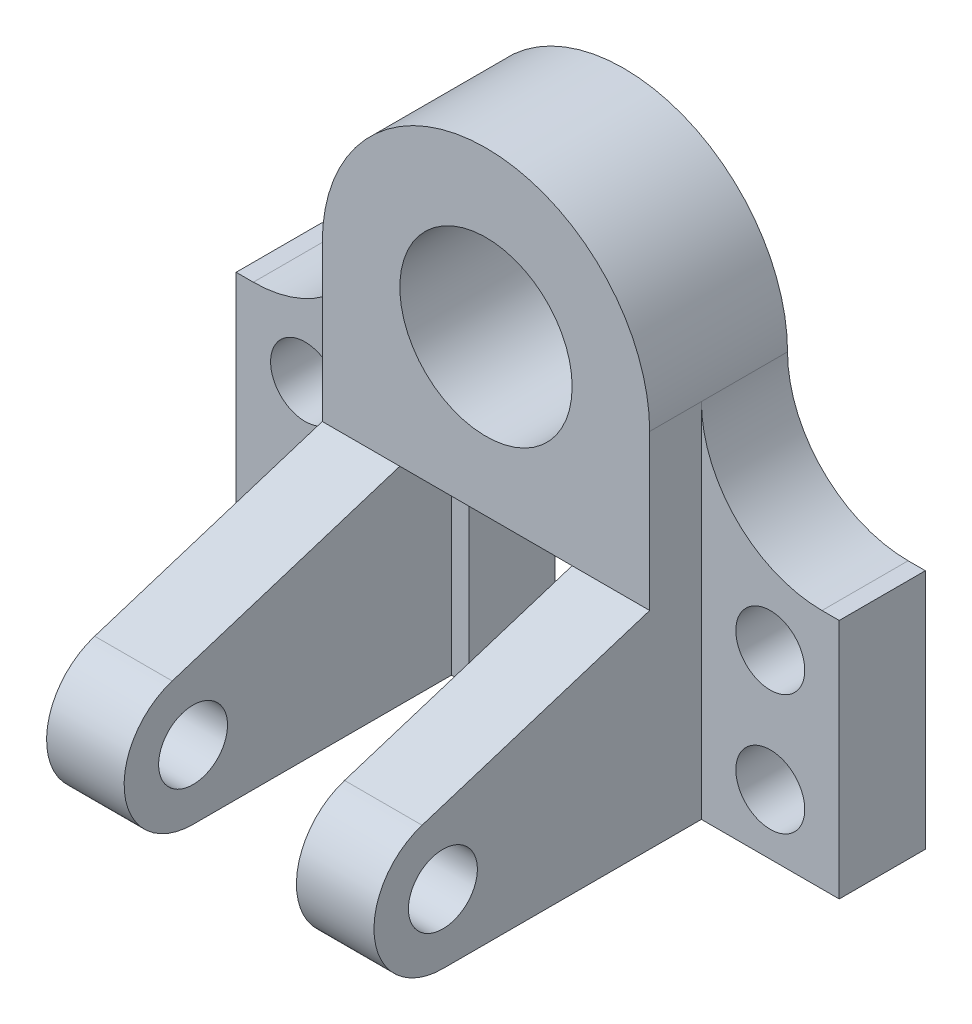
ISO-10303-21;
HEADER;
FILE_DESCRIPTION(('STEP AP214'),'2;1');
FILE_NAME('part.step','',(''),(''),'','','');
FILE_SCHEMA(('AUTOMOTIVE_DESIGN { 1 0 10303 214 1 1 1 1 }'));
ENDSEC;
DATA;
#1=APPLICATION_CONTEXT('core data for automotive mechanical design processes');
#2=APPLICATION_PROTOCOL_DEFINITION('international standard','automotive_design',2000,#1);
#3=PRODUCT_CONTEXT('',#1,'mechanical');
#4=PRODUCT('Part','Part','',(#3));
#5=PRODUCT_RELATED_PRODUCT_CATEGORY('part','',(#4));
#6=PRODUCT_DEFINITION_FORMATION('','',#4);
#7=PRODUCT_DEFINITION_CONTEXT('part definition',#1,'design');
#8=PRODUCT_DEFINITION('design','',#6,#7);
#9=PRODUCT_DEFINITION_SHAPE('','',#8);
#10=(LENGTH_UNIT() NAMED_UNIT(*) SI_UNIT(.MILLI.,.METRE.));
#11=(NAMED_UNIT(*) PLANE_ANGLE_UNIT() SI_UNIT($,.RADIAN.));
#12=(NAMED_UNIT(*) SI_UNIT($,.STERADIAN.) SOLID_ANGLE_UNIT());
#13=UNCERTAINTY_MEASURE_WITH_UNIT(LENGTH_MEASURE(1.E-05),#10,'distance_accuracy_value','');
#14=(GEOMETRIC_REPRESENTATION_CONTEXT(3) GLOBAL_UNCERTAINTY_ASSIGNED_CONTEXT((#13)) GLOBAL_UNIT_ASSIGNED_CONTEXT((#10,
#11,#12)) REPRESENTATION_CONTEXT('',''));
#15=CARTESIAN_POINT('',(0.,0.,0.));
#16=DIRECTION('',(0.,0.,1.));
#17=DIRECTION('',(1.,0.,0.));
#18=AXIS2_PLACEMENT_3D('',#15,#16,#17);
#19=CARTESIAN_POINT('',(-38.,-36.,32.));
#20=DIRECTION('',(0.,1.,0.));
#21=DIRECTION('',(0.,0.,1.));
#22=AXIS2_PLACEMENT_3D('',#19,#20,#21);
#23=PLANE('',#22);
#24=DIRECTION('',(0.,0.,-1.));
#25=VECTOR('',#24,1.);
#26=CARTESIAN_POINT('',(-20.,-36.,0.));
#27=LINE('',#26,#25);
#28=CARTESIAN_POINT('',(-20.,-36.,32.));
#29=VERTEX_POINT('',#28);
#30=CARTESIAN_POINT('',(-20.,-36.,20.));
#31=VERTEX_POINT('',#30);
#32=EDGE_CURVE('E324',#29,#31,#27,.T.);
#33=ORIENTED_EDGE('',*,*,#32,.T.);
#34=DIRECTION('',(-1.,0.,0.));
#35=VECTOR('',#34,1.);
#36=CARTESIAN_POINT('',(-16.,-36.,20.));
#37=LINE('',#36,#35);
#38=CARTESIAN_POINT('',(-16.,-36.,20.));
#39=VERTEX_POINT('',#38);
#40=EDGE_CURVE('E197',#39,#31,#37,.T.);
#41=ORIENTED_EDGE('',*,*,#40,.F.);
#42=DIRECTION('',(0.,0.,-1.));
#43=VECTOR('',#42,1.);
#44=CARTESIAN_POINT('',(-16.,-36.,0.));
#45=LINE('',#44,#43);
#46=CARTESIAN_POINT('',(-16.,-36.,0.));
#47=VERTEX_POINT('',#46);
#48=EDGE_CURVE('E186',#39,#47,#45,.T.);
#49=ORIENTED_EDGE('',*,*,#48,.T.);
#50=DIRECTION('',(1.,0.,0.));
#51=VECTOR('',#50,1.);
#52=CARTESIAN_POINT('',(-38.,-36.,0.));
#53=LINE('',#52,#51);
#54=CARTESIAN_POINT('',(16.,-36.,0.));
#55=VERTEX_POINT('',#54);
#56=EDGE_CURVE('E196',#47,#55,#53,.T.);
#57=ORIENTED_EDGE('',*,*,#56,.T.);
#58=DIRECTION('',(0.,0.,-1.));
#59=VECTOR('',#58,1.);
#60=CARTESIAN_POINT('',(16.,-36.,0.));
#61=LINE('',#60,#59);
#62=CARTESIAN_POINT('',(16.,-36.,20.));
#63=VERTEX_POINT('',#62);
#64=EDGE_CURVE('E56',#63,#55,#61,.T.);
#65=ORIENTED_EDGE('',*,*,#64,.F.);
#66=DIRECTION('',(1.,0.,0.));
#67=VECTOR('',#66,1.);
#68=CARTESIAN_POINT('',(16.,-36.,20.));
#69=LINE('',#68,#67);
#70=CARTESIAN_POINT('',(20.,-36.,20.));
#71=VERTEX_POINT('',#70);
#72=EDGE_CURVE('E492',#63,#71,#69,.T.);
#73=ORIENTED_EDGE('',*,*,#72,.T.);
#74=DIRECTION('',(0.,0.,-1.));
#75=VECTOR('',#74,1.);
#76=CARTESIAN_POINT('',(20.,-36.,20.));
#77=LINE('',#76,#75);
#78=CARTESIAN_POINT('',(20.,-36.,32.));
#79=VERTEX_POINT('',#78);
#80=EDGE_CURVE('E356',#79,#71,#77,.T.);
#81=ORIENTED_EDGE('',*,*,#80,.F.);
#82=DIRECTION('',(1.,0.,0.));
#83=VECTOR('',#82,1.);
#84=CARTESIAN_POINT('',(-38.,-36.,32.));
#85=LINE('',#84,#83);
#86=EDGE_CURVE('E286',#29,#79,#85,.T.);
#87=ORIENTED_EDGE('',*,*,#86,.F.);
#88=EDGE_LOOP('',(#33,#41,#49,#57,#65,#73,#81,#87));
#89=FACE_BOUND('',#88,.T.);
#90=ADVANCED_FACE('F33',(#89),#23,.F.);
#91=CARTESIAN_POINT('',(20.,-68.,80.));
#92=DIRECTION('',(1.,0.,0.));
#93=DIRECTION('',(0.,0.,-1.));
#94=AXIS2_PLACEMENT_3D('',#91,#92,#93);
#95=PLANE('',#94);
#96=CARTESIAN_POINT('',(20.,-68.,80.));
#97=DIRECTION('',(-1.,0.,0.));
#98=DIRECTION('',(0.,0.,1.));
#99=AXIS2_PLACEMENT_3D('',#96,#97,#98);
#100=CIRCLE('',#99,8.00000000000003);
#101=CARTESIAN_POINT('',(20.,-68.,88.));
#102=VERTEX_POINT('',#101);
#103=EDGE_CURVE('E342',#102,#102,#100,.T.);
#104=ORIENTED_EDGE('',*,*,#103,.F.);
#105=EDGE_LOOP('',(#104));
#106=FACE_BOUND('',#105,.T.);
#107=DIRECTION('',(0.,1.,0.));
#108=VECTOR('',#107,1.);
#109=CARTESIAN_POINT('',(20.,-36.,20.));
#110=LINE('',#109,#108);
#111=CARTESIAN_POINT('',(20.,-84.,20.));
#112=VERTEX_POINT('',#111);
#113=EDGE_CURVE('E484',#112,#71,#110,.T.);
#114=ORIENTED_EDGE('',*,*,#113,.F.);
#115=DIRECTION('',(0.,0.,1.));
#116=VECTOR('',#115,1.);
#117=CARTESIAN_POINT('',(20.,-84.,20.));
#118=LINE('',#117,#116);
#119=CARTESIAN_POINT('',(20.,-84.,80.));
#120=VERTEX_POINT('',#119);
#121=EDGE_CURVE('E348',#112,#120,#118,.T.);
#122=ORIENTED_EDGE('',*,*,#121,.T.);
#123=CARTESIAN_POINT('',(20.,-68.,80.));
#124=DIRECTION('',(-1.,0.,0.));
#125=DIRECTION('',(0.,0.,-1.));
#126=AXIS2_PLACEMENT_3D('',#123,#124,#125);
#127=CIRCLE('',#126,16.);
#128=CARTESIAN_POINT('',(20.,-52.7479324979529,84.8347116680314));
#129=VERTEX_POINT('',#128);
#130=EDGE_CURVE('E350',#120,#129,#127,.T.);
#131=ORIENTED_EDGE('',*,*,#130,.T.);
#132=DIRECTION('',(0.,0.302169479251963,-0.953254218877943));
#133=VECTOR('',#132,1.);
#134=CARTESIAN_POINT('',(20.,-36.,32.));
#135=LINE('',#134,#133);
#136=EDGE_CURVE('E353',#129,#79,#135,.T.);
#137=ORIENTED_EDGE('',*,*,#136,.T.);
#138=ORIENTED_EDGE('',*,*,#80,.T.);
#139=EDGE_LOOP('',(#114,#122,#131,#137,#138));
#140=FACE_BOUND('',#139,.T.);
#141=ADVANCED_FACE('F432',(#106,#140),#95,.F.);
#142=CARTESIAN_POINT('',(0.,0.,32.));
#143=DIRECTION('',(0.,0.,1.));
#144=DIRECTION('',(1.,0.,0.));
#145=AXIS2_PLACEMENT_3D('',#142,#143,#144);
#146=PLANE('',#145);
#147=CARTESIAN_POINT('',(0.,0.,32.));
#148=DIRECTION('',(0.,0.,1.));
#149=DIRECTION('',(1.,0.,0.));
#150=AXIS2_PLACEMENT_3D('',#147,#148,#149);
#151=CIRCLE('',#150,38.);
#152=CARTESIAN_POINT('',(38.,0.,32.));
#153=VERTEX_POINT('',#152);
#154=CARTESIAN_POINT('',(-38.,0.,32.));
#155=VERTEX_POINT('',#154);
#156=EDGE_CURVE('E205',#153,#155,#151,.T.);
#157=ORIENTED_EDGE('',*,*,#156,.T.);
#158=DIRECTION('',(0.,-1.,0.));
#159=VECTOR('',#158,1.);
#160=CARTESIAN_POINT('',(-38.,0.,32.));
#161=LINE('',#160,#159);
#162=CARTESIAN_POINT('',(-38.,-36.,32.));
#163=VERTEX_POINT('',#162);
#164=EDGE_CURVE('E209',#155,#163,#161,.T.);
#165=ORIENTED_EDGE('',*,*,#164,.T.);
#166=EDGE_CURVE('E287',#163,#29,#85,.T.);
#167=ORIENTED_EDGE('',*,*,#166,.T.);
#168=ORIENTED_EDGE('',*,*,#86,.T.);
#169=DIRECTION('',(1.,0.,0.));
#170=VECTOR('',#169,1.);
#171=CARTESIAN_POINT('',(20.,-36.,32.));
#172=LINE('',#171,#170);
#173=CARTESIAN_POINT('',(38.,-36.,32.));
#174=VERTEX_POINT('',#173);
#175=EDGE_CURVE('E297',#79,#174,#172,.T.);
#176=ORIENTED_EDGE('',*,*,#175,.T.);
#177=DIRECTION('',(0.,1.,0.));
#178=VECTOR('',#177,1.);
#179=CARTESIAN_POINT('',(38.,0.,32.));
#180=LINE('',#179,#178);
#181=EDGE_CURVE('E289',#174,#153,#180,.T.);
#182=ORIENTED_EDGE('',*,*,#181,.T.);
#183=EDGE_LOOP('',(#157,#165,#167,#168,#176,#182));
#184=FACE_BOUND('',#183,.T.);
#185=CARTESIAN_POINT('',(0.,0.,32.));
#186=DIRECTION('',(0.,0.,1.));
#187=DIRECTION('',(1.,0.,0.));
#188=AXIS2_PLACEMENT_3D('',#185,#186,#187);
#189=CIRCLE('',#188,20.);
#190=CARTESIAN_POINT('',(20.,0.,32.));
#191=VERTEX_POINT('',#190);
#192=EDGE_CURVE('E212',#191,#191,#189,.T.);
#193=ORIENTED_EDGE('',*,*,#192,.F.);
#194=EDGE_LOOP('',(#193));
#195=FACE_BOUND('',#194,.T.);
#196=ADVANCED_FACE('F293',(#184,#195),#146,.T.);
#197=CARTESIAN_POINT('',(0.,0.,0.));
#198=DIRECTION('',(0.,0.,1.));
#199=DIRECTION('',(1.,0.,0.));
#200=AXIS2_PLACEMENT_3D('',#197,#198,#199);
#201=PLANE('',#200);
#202=ORIENTED_EDGE('',*,*,#56,.F.);
#203=DIRECTION('',(0.,-1.,0.));
#204=VECTOR('',#203,1.);
#205=CARTESIAN_POINT('',(-16.,-36.,0.));
#206=LINE('',#205,#204);
#207=CARTESIAN_POINT('',(-16.,-84.,0.));
#208=VERTEX_POINT('',#207);
#209=EDGE_CURVE('E182',#47,#208,#206,.T.);
#210=ORIENTED_EDGE('',*,*,#209,.T.);
#211=DIRECTION('',(1.,0.,0.));
#212=VECTOR('',#211,1.);
#213=CARTESIAN_POINT('',(-70.,-84.,0.));
#214=LINE('',#213,#212);
#215=CARTESIAN_POINT('',(-70.,-84.,0.));
#216=VERTEX_POINT('',#215);
#217=EDGE_CURVE('E266',#216,#208,#214,.T.);
#218=ORIENTED_EDGE('',*,*,#217,.F.);
#219=DIRECTION('',(0.,-1.,0.));
#220=VECTOR('',#219,1.);
#221=CARTESIAN_POINT('',(-70.,-84.,0.));
#222=LINE('',#221,#220);
#223=CARTESIAN_POINT('',(-70.,-28.,0.));
#224=VERTEX_POINT('',#223);
#225=EDGE_CURVE('E273',#224,#216,#222,.T.);
#226=ORIENTED_EDGE('',*,*,#225,.F.);
#227=DIRECTION('',(-1.,0.,0.));
#228=VECTOR('',#227,1.);
#229=CARTESIAN_POINT('',(-70.,-28.,0.));
#230=LINE('',#229,#228);
#231=CARTESIAN_POINT('',(-66.,-28.,0.));
#232=VERTEX_POINT('',#231);
#233=EDGE_CURVE('E238',#232,#224,#230,.T.);
#234=ORIENTED_EDGE('',*,*,#233,.F.);
#235=CARTESIAN_POINT('',(-66.,0.,0.));
#236=DIRECTION('',(0.,0.,1.));
#237=DIRECTION('',(1.,0.,0.));
#238=AXIS2_PLACEMENT_3D('',#235,#236,#237);
#239=CIRCLE('',#238,28.);
#240=CARTESIAN_POINT('',(-38.,0.,0.));
#241=VERTEX_POINT('',#240);
#242=EDGE_CURVE('E41',#232,#241,#239,.T.);
#243=ORIENTED_EDGE('',*,*,#242,.T.);
#244=CARTESIAN_POINT('',(0.,0.,0.));
#245=DIRECTION('',(0.,0.,1.));
#246=DIRECTION('',(1.,0.,0.));
#247=AXIS2_PLACEMENT_3D('',#244,#245,#246);
#248=CIRCLE('',#247,38.);
#249=CARTESIAN_POINT('',(38.,0.,0.));
#250=VERTEX_POINT('',#249);
#251=EDGE_CURVE('E206',#250,#241,#248,.T.);
#252=ORIENTED_EDGE('',*,*,#251,.F.);
#253=CARTESIAN_POINT('',(66.,0.,0.));
#254=DIRECTION('',(0.,0.,1.));
#255=DIRECTION('',(1.,0.,0.));
#256=AXIS2_PLACEMENT_3D('',#253,#254,#255);
#257=CIRCLE('',#256,28.);
#258=CARTESIAN_POINT('',(66.,-28.,0.));
#259=VERTEX_POINT('',#258);
#260=EDGE_CURVE('E228',#250,#259,#257,.T.);
#261=ORIENTED_EDGE('',*,*,#260,.T.);
#262=DIRECTION('',(1.,0.,0.));
#263=VECTOR('',#262,1.);
#264=CARTESIAN_POINT('',(70.,-28.,0.));
#265=LINE('',#264,#263);
#266=CARTESIAN_POINT('',(70.,-28.,0.));
#267=VERTEX_POINT('',#266);
#268=EDGE_CURVE('E386',#259,#267,#265,.T.);
#269=ORIENTED_EDGE('',*,*,#268,.T.);
#270=DIRECTION('',(0.,-1.,0.));
#271=VECTOR('',#270,1.);
#272=CARTESIAN_POINT('',(70.,-84.,0.));
#273=LINE('',#272,#271);
#274=CARTESIAN_POINT('',(70.,-84.,0.));
#275=VERTEX_POINT('',#274);
#276=EDGE_CURVE('E393',#267,#275,#273,.T.);
#277=ORIENTED_EDGE('',*,*,#276,.T.);
#278=DIRECTION('',(-1.,0.,0.));
#279=VECTOR('',#278,1.);
#280=CARTESIAN_POINT('',(70.,-84.,0.));
#281=LINE('',#280,#279);
#282=CARTESIAN_POINT('',(16.,-84.,0.));
#283=VERTEX_POINT('',#282);
#284=EDGE_CURVE('E379',#275,#283,#281,.T.);
#285=ORIENTED_EDGE('',*,*,#284,.T.);
#286=DIRECTION('',(0.,-1.,0.));
#287=VECTOR('',#286,1.);
#288=CARTESIAN_POINT('',(16.,-36.,0.));
#289=LINE('',#288,#287);
#290=EDGE_CURVE('E204',#55,#283,#289,.T.);
#291=ORIENTED_EDGE('',*,*,#290,.F.);
#292=EDGE_LOOP('',(#202,#210,#218,#226,#234,#243,#252,#261,#269,#277,#285,#291));
#293=FACE_BOUND('',#292,.T.);
#294=CARTESIAN_POINT('',(0.,0.,0.));
#295=DIRECTION('',(0.,0.,1.));
#296=DIRECTION('',(1.,0.,0.));
#297=AXIS2_PLACEMENT_3D('',#294,#295,#296);
#298=CIRCLE('',#297,20.);
#299=CARTESIAN_POINT('',(20.,0.,0.));
#300=VERTEX_POINT('',#299);
#301=EDGE_CURVE('E280',#300,#300,#298,.T.);
#302=ORIENTED_EDGE('',*,*,#301,.T.);
#303=EDGE_LOOP('',(#302));
#304=FACE_BOUND('',#303,.T.);
#305=CARTESIAN_POINT('',(-54.,-42.,0.));
#306=DIRECTION('',(0.,0.,1.));
#307=DIRECTION('',(1.,0.,0.));
#308=AXIS2_PLACEMENT_3D('',#305,#306,#307);
#309=CIRCLE('',#308,8.);
#310=CARTESIAN_POINT('',(-46.,-42.,0.));
#311=VERTEX_POINT('',#310);
#312=EDGE_CURVE('E405',#311,#311,#309,.T.);
#313=ORIENTED_EDGE('',*,*,#312,.T.);
#314=EDGE_LOOP('',(#313));
#315=FACE_BOUND('',#314,.T.);
#316=CARTESIAN_POINT('',(-54.,-70.,0.));
#317=DIRECTION('',(0.,0.,1.));
#318=DIRECTION('',(1.,0.,0.));
#319=AXIS2_PLACEMENT_3D('',#316,#317,#318);
#320=CIRCLE('',#319,8.);
#321=CARTESIAN_POINT('',(-46.,-70.,0.));
#322=VERTEX_POINT('',#321);
#323=EDGE_CURVE('E401',#322,#322,#320,.T.);
#324=ORIENTED_EDGE('',*,*,#323,.T.);
#325=EDGE_LOOP('',(#324));
#326=FACE_BOUND('',#325,.T.);
#327=CARTESIAN_POINT('',(54.,-70.,0.));
#328=DIRECTION('',(0.,0.,-1.));
#329=DIRECTION('',(-1.,0.,0.));
#330=AXIS2_PLACEMENT_3D('',#327,#328,#329);
#331=CIRCLE('',#330,8.);
#332=CARTESIAN_POINT('',(46.,-70.,0.));
#333=VERTEX_POINT('',#332);
#334=EDGE_CURVE('E369',#333,#333,#331,.T.);
#335=ORIENTED_EDGE('',*,*,#334,.F.);
#336=EDGE_LOOP('',(#335));
#337=FACE_BOUND('',#336,.T.);
#338=CARTESIAN_POINT('',(54.,-42.,0.));
#339=DIRECTION('',(0.,0.,-1.));
#340=DIRECTION('',(-1.,0.,0.));
#341=AXIS2_PLACEMENT_3D('',#338,#339,#340);
#342=CIRCLE('',#341,8.);
#343=CARTESIAN_POINT('',(46.,-42.,0.));
#344=VERTEX_POINT('',#343);
#345=EDGE_CURVE('E373',#344,#344,#342,.T.);
#346=ORIENTED_EDGE('',*,*,#345,.F.);
#347=EDGE_LOOP('',(#346));
#348=FACE_BOUND('',#347,.T.);
#349=ADVANCED_FACE('F201',(#293,#304,#315,#326,#337,#348),#201,.F.);
#350=CARTESIAN_POINT('',(0.,0.,32.));
#351=DIRECTION('',(0.,0.,-1.));
#352=DIRECTION('',(-1.,0.,0.));
#353=AXIS2_PLACEMENT_3D('',#350,#351,#352);
#354=CYLINDRICAL_SURFACE('',#353,38.);
#355=ORIENTED_EDGE('',*,*,#251,.T.);
#356=DIRECTION('',(0.,0.,-1.));
#357=VECTOR('',#356,1.);
#358=CARTESIAN_POINT('',(-38.,0.,32.));
#359=LINE('',#358,#357);
#360=CARTESIAN_POINT('',(-38.,0.,20.));
#361=VERTEX_POINT('',#360);
#362=EDGE_CURVE('E219',#361,#241,#359,.T.);
#363=ORIENTED_EDGE('',*,*,#362,.F.);
#364=EDGE_CURVE('E221',#155,#361,#359,.T.);
#365=ORIENTED_EDGE('',*,*,#364,.F.);
#366=ORIENTED_EDGE('',*,*,#156,.F.);
#367=DIRECTION('',(0.,0.,-1.));
#368=VECTOR('',#367,1.);
#369=CARTESIAN_POINT('',(38.,0.,32.));
#370=LINE('',#369,#368);
#371=CARTESIAN_POINT('',(38.,0.,20.));
#372=VERTEX_POINT('',#371);
#373=EDGE_CURVE('E216',#153,#372,#370,.T.);
#374=ORIENTED_EDGE('',*,*,#373,.T.);
#375=EDGE_CURVE('E220',#372,#250,#370,.T.);
#376=ORIENTED_EDGE('',*,*,#375,.T.);
#377=EDGE_LOOP('',(#355,#363,#365,#366,#374,#376));
#378=FACE_BOUND('',#377,.T.);
#379=ADVANCED_FACE('F245',(#378),#354,.T.);
#380=CARTESIAN_POINT('',(-38.,0.,32.));
#381=DIRECTION('',(1.,0.,0.));
#382=DIRECTION('',(0.,1.,0.));
#383=AXIS2_PLACEMENT_3D('',#380,#381,#382);
#384=PLANE('',#383);
#385=ORIENTED_EDGE('',*,*,#364,.T.);
#386=DIRECTION('',(0.,1.,0.));
#387=VECTOR('',#386,1.);
#388=CARTESIAN_POINT('',(-38.,-36.,20.));
#389=LINE('',#388,#387);
#390=CARTESIAN_POINT('',(-38.,-84.,20.));
#391=VERTEX_POINT('',#390);
#392=EDGE_CURVE('E256',#391,#361,#389,.T.);
#393=ORIENTED_EDGE('',*,*,#392,.F.);
#394=DIRECTION('',(0.,0.,1.));
#395=VECTOR('',#394,1.);
#396=CARTESIAN_POINT('',(-38.,-84.,20.));
#397=LINE('',#396,#395);
#398=CARTESIAN_POINT('',(-38.,-84.,80.));
#399=VERTEX_POINT('',#398);
#400=EDGE_CURVE('E336',#391,#399,#397,.T.);
#401=ORIENTED_EDGE('',*,*,#400,.T.);
#402=CARTESIAN_POINT('',(-38.,-68.,80.));
#403=DIRECTION('',(-1.,0.,0.));
#404=DIRECTION('',(0.,0.,-1.));
#405=AXIS2_PLACEMENT_3D('',#402,#403,#404);
#406=CIRCLE('',#405,16.);
#407=CARTESIAN_POINT('',(-38.,-52.7479324979529,84.8347116680314));
#408=VERTEX_POINT('',#407);
#409=EDGE_CURVE('E333',#399,#408,#406,.T.);
#410=ORIENTED_EDGE('',*,*,#409,.T.);
#411=DIRECTION('',(0.,0.302169479251963,-0.953254218877943));
#412=VECTOR('',#411,1.);
#413=CARTESIAN_POINT('',(-38.,-36.,32.));
#414=LINE('',#413,#412);
#415=EDGE_CURVE('E311',#408,#163,#414,.T.);
#416=ORIENTED_EDGE('',*,*,#415,.T.);
#417=ORIENTED_EDGE('',*,*,#164,.F.);
#418=EDGE_LOOP('',(#385,#393,#401,#410,#416,#417));
#419=FACE_BOUND('',#418,.T.);
#420=CARTESIAN_POINT('',(-38.,-68.,80.));
#421=DIRECTION('',(-1.,0.,0.));
#422=DIRECTION('',(0.,0.,1.));
#423=AXIS2_PLACEMENT_3D('',#420,#421,#422);
#424=CIRCLE('',#423,8.00000000000003);
#425=CARTESIAN_POINT('',(-38.,-68.,88.));
#426=VERTEX_POINT('',#425);
#427=EDGE_CURVE('E496',#426,#426,#424,.T.);
#428=ORIENTED_EDGE('',*,*,#427,.F.);
#429=EDGE_LOOP('',(#428));
#430=FACE_BOUND('',#429,.T.);
#431=ADVANCED_FACE('F305',(#419,#430),#384,.F.);
#432=CARTESIAN_POINT('',(38.,0.,32.));
#433=DIRECTION('',(-1.,0.,0.));
#434=DIRECTION('',(0.,-1.,0.));
#435=AXIS2_PLACEMENT_3D('',#432,#433,#434);
#436=PLANE('',#435);
#437=DIRECTION('',(0.,1.,0.));
#438=VECTOR('',#437,1.);
#439=CARTESIAN_POINT('',(38.,0.,20.));
#440=LINE('',#439,#438);
#441=CARTESIAN_POINT('',(38.,-84.,20.));
#442=VERTEX_POINT('',#441);
#443=EDGE_CURVE('E224',#442,#372,#440,.T.);
#444=ORIENTED_EDGE('',*,*,#443,.T.);
#445=ORIENTED_EDGE('',*,*,#373,.F.);
#446=ORIENTED_EDGE('',*,*,#181,.F.);
#447=DIRECTION('',(0.,0.302169479251963,-0.953254218877943));
#448=VECTOR('',#447,1.);
#449=CARTESIAN_POINT('',(38.,-36.,32.));
#450=LINE('',#449,#448);
#451=CARTESIAN_POINT('',(38.,-52.7479324979529,84.8347116680314));
#452=VERTEX_POINT('',#451);
#453=EDGE_CURVE('E351',#452,#174,#450,.T.);
#454=ORIENTED_EDGE('',*,*,#453,.F.);
#455=CARTESIAN_POINT('',(38.,-68.,80.));
#456=DIRECTION('',(-1.,0.,0.));
#457=DIRECTION('',(0.,0.,-1.));
#458=AXIS2_PLACEMENT_3D('',#455,#456,#457);
#459=CIRCLE('',#458,16.);
#460=CARTESIAN_POINT('',(38.,-84.,80.));
#461=VERTEX_POINT('',#460);
#462=EDGE_CURVE('E359',#461,#452,#459,.T.);
#463=ORIENTED_EDGE('',*,*,#462,.F.);
#464=DIRECTION('',(0.,0.,1.));
#465=VECTOR('',#464,1.);
#466=CARTESIAN_POINT('',(38.,-84.,20.));
#467=LINE('',#466,#465);
#468=EDGE_CURVE('E345',#442,#461,#467,.T.);
#469=ORIENTED_EDGE('',*,*,#468,.F.);
#470=EDGE_LOOP('',(#444,#445,#446,#454,#463,#469));
#471=FACE_BOUND('',#470,.T.);
#472=CARTESIAN_POINT('',(38.,-68.,80.));
#473=DIRECTION('',(-1.,0.,0.));
#474=DIRECTION('',(0.,0.,1.));
#475=AXIS2_PLACEMENT_3D('',#472,#473,#474);
#476=CIRCLE('',#475,8.00000000000003);
#477=CARTESIAN_POINT('',(38.,-68.,88.));
#478=VERTEX_POINT('',#477);
#479=EDGE_CURVE('E341',#478,#478,#476,.T.);
#480=ORIENTED_EDGE('',*,*,#479,.T.);
#481=EDGE_LOOP('',(#480));
#482=FACE_BOUND('',#481,.T.);
#483=ADVANCED_FACE('F301',(#471,#482),#436,.F.);
#484=CARTESIAN_POINT('',(0.,0.,32.));
#485=DIRECTION('',(0.,0.,-1.));
#486=DIRECTION('',(-1.,0.,0.));
#487=AXIS2_PLACEMENT_3D('',#484,#485,#486);
#488=CYLINDRICAL_SURFACE('',#487,20.);
#489=ORIENTED_EDGE('',*,*,#192,.T.);
#490=EDGE_LOOP('',(#489));
#491=FACE_BOUND('',#490,.T.);
#492=ORIENTED_EDGE('',*,*,#301,.F.);
#493=EDGE_LOOP('',(#492));
#494=FACE_BOUND('',#493,.T.);
#495=ADVANCED_FACE('F612',(#491,#494),#488,.F.);
#496=CARTESIAN_POINT('',(0.,0.,20.));
#497=DIRECTION('',(0.,0.,1.));
#498=DIRECTION('',(1.,0.,0.));
#499=AXIS2_PLACEMENT_3D('',#496,#497,#498);
#500=PLANE('',#499);
#501=CARTESIAN_POINT('',(-54.,-42.,20.));
#502=DIRECTION('',(0.,0.,1.));
#503=DIRECTION('',(1.,0.,0.));
#504=AXIS2_PLACEMENT_3D('',#501,#502,#503);
#505=CIRCLE('',#504,8.);
#506=CARTESIAN_POINT('',(-46.,-42.,20.));
#507=VERTEX_POINT('',#506);
#508=EDGE_CURVE('E274',#507,#507,#505,.T.);
#509=ORIENTED_EDGE('',*,*,#508,.F.);
#510=EDGE_LOOP('',(#509));
#511=FACE_BOUND('',#510,.T.);
#512=ORIENTED_EDGE('',*,*,#392,.T.);
#513=CARTESIAN_POINT('',(-66.,0.,20.));
#514=DIRECTION('',(0.,0.,1.));
#515=DIRECTION('',(1.,0.,0.));
#516=AXIS2_PLACEMENT_3D('',#513,#514,#515);
#517=CIRCLE('',#516,28.);
#518=CARTESIAN_POINT('',(-66.,-28.,20.));
#519=VERTEX_POINT('',#518);
#520=EDGE_CURVE('E11',#361,#519,#517,.F.);
#521=ORIENTED_EDGE('',*,*,#520,.T.);
#522=DIRECTION('',(-1.,0.,0.));
#523=VECTOR('',#522,1.);
#524=CARTESIAN_POINT('',(-70.,-28.,20.));
#525=LINE('',#524,#523);
#526=CARTESIAN_POINT('',(-70.,-28.,20.));
#527=VERTEX_POINT('',#526);
#528=EDGE_CURVE('E253',#519,#527,#525,.T.);
#529=ORIENTED_EDGE('',*,*,#528,.T.);
#530=DIRECTION('',(0.,-1.,0.));
#531=VECTOR('',#530,1.);
#532=CARTESIAN_POINT('',(-70.,-84.,20.));
#533=LINE('',#532,#531);
#534=CARTESIAN_POINT('',(-70.,-84.,20.));
#535=VERTEX_POINT('',#534);
#536=EDGE_CURVE('E262',#527,#535,#533,.T.);
#537=ORIENTED_EDGE('',*,*,#536,.T.);
#538=DIRECTION('',(1.,0.,0.));
#539=VECTOR('',#538,1.);
#540=CARTESIAN_POINT('',(-70.,-84.,20.));
#541=LINE('',#540,#539);
#542=EDGE_CURVE('E264',#535,#391,#541,.T.);
#543=ORIENTED_EDGE('',*,*,#542,.T.);
#544=EDGE_LOOP('',(#512,#521,#529,#537,#543));
#545=FACE_BOUND('',#544,.T.);
#546=CARTESIAN_POINT('',(-54.,-70.,20.));
#547=DIRECTION('',(0.,0.,1.));
#548=DIRECTION('',(1.,0.,0.));
#549=AXIS2_PLACEMENT_3D('',#546,#547,#548);
#550=CIRCLE('',#549,8.);
#551=CARTESIAN_POINT('',(-46.,-70.,20.));
#552=VERTEX_POINT('',#551);
#553=EDGE_CURVE('E402',#552,#552,#550,.T.);
#554=ORIENTED_EDGE('',*,*,#553,.F.);
#555=EDGE_LOOP('',(#554));
#556=FACE_BOUND('',#555,.T.);
#557=ADVANCED_FACE('F251',(#511,#545,#556),#500,.T.);
#558=CARTESIAN_POINT('',(-70.,-28.,20.));
#559=DIRECTION('',(0.,-1.,0.));
#560=DIRECTION('',(0.,0.,-1.));
#561=AXIS2_PLACEMENT_3D('',#558,#559,#560);
#562=PLANE('',#561);
#563=ORIENTED_EDGE('',*,*,#528,.F.);
#564=DIRECTION('',(0.,0.,-1.));
#565=VECTOR('',#564,1.);
#566=CARTESIAN_POINT('',(-66.,-28.,0.));
#567=LINE('',#566,#565);
#568=EDGE_CURVE('E233',#519,#232,#567,.T.);
#569=ORIENTED_EDGE('',*,*,#568,.T.);
#570=ORIENTED_EDGE('',*,*,#233,.T.);
#571=DIRECTION('',(0.,0.,-1.));
#572=VECTOR('',#571,1.);
#573=CARTESIAN_POINT('',(-70.,-28.,20.));
#574=LINE('',#573,#572);
#575=EDGE_CURVE('E260',#527,#224,#574,.T.);
#576=ORIENTED_EDGE('',*,*,#575,.F.);
#577=EDGE_LOOP('',(#563,#569,#570,#576));
#578=FACE_BOUND('',#577,.T.);
#579=ADVANCED_FACE('F258',(#578),#562,.F.);
#580=CARTESIAN_POINT('',(-70.,-84.,20.));
#581=DIRECTION('',(1.,0.,0.));
#582=DIRECTION('',(0.,1.,0.));
#583=AXIS2_PLACEMENT_3D('',#580,#581,#582);
#584=PLANE('',#583);
#585=ORIENTED_EDGE('',*,*,#225,.T.);
#586=DIRECTION('',(0.,0.,-1.));
#587=VECTOR('',#586,1.);
#588=CARTESIAN_POINT('',(-70.,-84.,20.));
#589=LINE('',#588,#587);
#590=EDGE_CURVE('E271',#535,#216,#589,.T.);
#591=ORIENTED_EDGE('',*,*,#590,.F.);
#592=ORIENTED_EDGE('',*,*,#536,.F.);
#593=ORIENTED_EDGE('',*,*,#575,.T.);
#594=EDGE_LOOP('',(#585,#591,#592,#593));
#595=FACE_BOUND('',#594,.T.);
#596=ADVANCED_FACE('F427',(#595),#584,.F.);
#597=CARTESIAN_POINT('',(-70.,-84.,20.));
#598=DIRECTION('',(0.,1.,0.));
#599=DIRECTION('',(0.,0.,1.));
#600=AXIS2_PLACEMENT_3D('',#597,#598,#599);
#601=PLANE('',#600);
#602=ORIENTED_EDGE('',*,*,#217,.T.);
#603=DIRECTION('',(0.,0.,1.));
#604=VECTOR('',#603,1.);
#605=CARTESIAN_POINT('',(-16.,-84.,0.));
#606=LINE('',#605,#604);
#607=CARTESIAN_POINT('',(-16.,-84.,20.));
#608=VERTEX_POINT('',#607);
#609=EDGE_CURVE('E189',#208,#608,#606,.T.);
#610=ORIENTED_EDGE('',*,*,#609,.T.);
#611=DIRECTION('',(-1.,0.,0.));
#612=VECTOR('',#611,1.);
#613=CARTESIAN_POINT('',(-16.,-84.,20.));
#614=LINE('',#613,#612);
#615=CARTESIAN_POINT('',(-20.,-84.,20.));
#616=VERTEX_POINT('',#615);
#617=EDGE_CURVE('E503',#608,#616,#614,.T.);
#618=ORIENTED_EDGE('',*,*,#617,.T.);
#619=DIRECTION('',(0.,0.,1.));
#620=VECTOR('',#619,1.);
#621=CARTESIAN_POINT('',(-20.,-84.,20.));
#622=LINE('',#621,#620);
#623=CARTESIAN_POINT('',(-20.,-84.,80.));
#624=VERTEX_POINT('',#623);
#625=EDGE_CURVE('E328',#616,#624,#622,.T.);
#626=ORIENTED_EDGE('',*,*,#625,.T.);
#627=DIRECTION('',(-1.,0.,0.));
#628=VECTOR('',#627,1.);
#629=CARTESIAN_POINT('',(-20.,-84.,80.));
#630=LINE('',#629,#628);
#631=EDGE_CURVE('E326',#624,#399,#630,.T.);
#632=ORIENTED_EDGE('',*,*,#631,.T.);
#633=ORIENTED_EDGE('',*,*,#400,.F.);
#634=ORIENTED_EDGE('',*,*,#542,.F.);
#635=ORIENTED_EDGE('',*,*,#590,.T.);
#636=EDGE_LOOP('',(#602,#610,#618,#626,#632,#633,#634,#635));
#637=FACE_BOUND('',#636,.T.);
#638=ADVANCED_FACE('F417',(#637),#601,.F.);
#639=CARTESIAN_POINT('',(-54.,-42.,20.));
#640=DIRECTION('',(0.,0.,-1.));
#641=DIRECTION('',(-1.,0.,0.));
#642=AXIS2_PLACEMENT_3D('',#639,#640,#641);
#643=CYLINDRICAL_SURFACE('',#642,8.);
#644=ORIENTED_EDGE('',*,*,#508,.T.);
#645=EDGE_LOOP('',(#644));
#646=FACE_BOUND('',#645,.T.);
#647=ORIENTED_EDGE('',*,*,#312,.F.);
#648=EDGE_LOOP('',(#647));
#649=FACE_BOUND('',#648,.T.);
#650=ADVANCED_FACE('F414',(#646,#649),#643,.F.);
#651=CARTESIAN_POINT('',(-54.,-70.,20.));
#652=DIRECTION('',(0.,0.,-1.));
#653=DIRECTION('',(-1.,0.,0.));
#654=AXIS2_PLACEMENT_3D('',#651,#652,#653);
#655=CYLINDRICAL_SURFACE('',#654,8.);
#656=ORIENTED_EDGE('',*,*,#553,.T.);
#657=EDGE_LOOP('',(#656));
#658=FACE_BOUND('',#657,.T.);
#659=ORIENTED_EDGE('',*,*,#323,.F.);
#660=EDGE_LOOP('',(#659));
#661=FACE_BOUND('',#660,.T.);
#662=ADVANCED_FACE('F416',(#658,#661),#655,.F.);
#663=CARTESIAN_POINT('',(70.,-84.,20.));
#664=DIRECTION('',(0.,-1.,0.));
#665=DIRECTION('',(0.,0.,-1.));
#666=AXIS2_PLACEMENT_3D('',#663,#664,#665);
#667=PLANE('',#666);
#668=ORIENTED_EDGE('',*,*,#284,.F.);
#669=DIRECTION('',(0.,0.,-1.));
#670=VECTOR('',#669,1.);
#671=CARTESIAN_POINT('',(70.,-84.,20.));
#672=LINE('',#671,#670);
#673=CARTESIAN_POINT('',(70.,-84.,20.));
#674=VERTEX_POINT('',#673);
#675=EDGE_CURVE('E399',#674,#275,#672,.T.);
#676=ORIENTED_EDGE('',*,*,#675,.F.);
#677=DIRECTION('',(-1.,0.,0.));
#678=VECTOR('',#677,1.);
#679=CARTESIAN_POINT('',(70.,-84.,20.));
#680=LINE('',#679,#678);
#681=EDGE_CURVE('E382',#674,#442,#680,.T.);
#682=ORIENTED_EDGE('',*,*,#681,.T.);
#683=ORIENTED_EDGE('',*,*,#468,.T.);
#684=DIRECTION('',(1.,0.,0.));
#685=VECTOR('',#684,1.);
#686=CARTESIAN_POINT('',(20.,-84.,80.));
#687=LINE('',#686,#685);
#688=EDGE_CURVE('E366',#120,#461,#687,.T.);
#689=ORIENTED_EDGE('',*,*,#688,.F.);
#690=ORIENTED_EDGE('',*,*,#121,.F.);
#691=DIRECTION('',(1.,0.,0.));
#692=VECTOR('',#691,1.);
#693=CARTESIAN_POINT('',(16.,-84.,20.));
#694=LINE('',#693,#692);
#695=CARTESIAN_POINT('',(16.,-84.,20.));
#696=VERTEX_POINT('',#695);
#697=EDGE_CURVE('E478',#696,#112,#694,.T.);
#698=ORIENTED_EDGE('',*,*,#697,.F.);
#699=DIRECTION('',(0.,0.,1.));
#700=VECTOR('',#699,1.);
#701=CARTESIAN_POINT('',(16.,-84.,0.));
#702=LINE('',#701,#700);
#703=EDGE_CURVE('E475',#283,#696,#702,.T.);
#704=ORIENTED_EDGE('',*,*,#703,.F.);
#705=EDGE_LOOP('',(#668,#676,#682,#683,#689,#690,#698,#704));
#706=FACE_BOUND('',#705,.T.);
#707=ADVANCED_FACE('F424',(#706),#667,.T.);
#708=CARTESIAN_POINT('',(70.,-84.,20.));
#709=DIRECTION('',(1.,0.,0.));
#710=DIRECTION('',(0.,1.,0.));
#711=AXIS2_PLACEMENT_3D('',#708,#709,#710);
#712=PLANE('',#711);
#713=ORIENTED_EDGE('',*,*,#276,.F.);
#714=DIRECTION('',(0.,0.,-1.));
#715=VECTOR('',#714,1.);
#716=CARTESIAN_POINT('',(70.,-28.,20.));
#717=LINE('',#716,#715);
#718=CARTESIAN_POINT('',(70.,-28.,20.));
#719=VERTEX_POINT('',#718);
#720=EDGE_CURVE('E391',#719,#267,#717,.T.);
#721=ORIENTED_EDGE('',*,*,#720,.F.);
#722=DIRECTION('',(0.,-1.,0.));
#723=VECTOR('',#722,1.);
#724=CARTESIAN_POINT('',(70.,-84.,20.));
#725=LINE('',#724,#723);
#726=EDGE_CURVE('E385',#719,#674,#725,.T.);
#727=ORIENTED_EDGE('',*,*,#726,.T.);
#728=ORIENTED_EDGE('',*,*,#675,.T.);
#729=EDGE_LOOP('',(#713,#721,#727,#728));
#730=FACE_BOUND('',#729,.T.);
#731=ADVANCED_FACE('F470',(#730),#712,.T.);
#732=CARTESIAN_POINT('',(70.,-28.,20.));
#733=DIRECTION('',(0.,1.,0.));
#734=DIRECTION('',(0.,0.,1.));
#735=AXIS2_PLACEMENT_3D('',#732,#733,#734);
#736=PLANE('',#735);
#737=ORIENTED_EDGE('',*,*,#268,.F.);
#738=DIRECTION('',(0.,0.,-1.));
#739=VECTOR('',#738,1.);
#740=CARTESIAN_POINT('',(66.,-28.,20.));
#741=LINE('',#740,#739);
#742=CARTESIAN_POINT('',(66.,-28.,20.));
#743=VERTEX_POINT('',#742);
#744=EDGE_CURVE('E226',#259,#743,#741,.F.);
#745=ORIENTED_EDGE('',*,*,#744,.T.);
#746=DIRECTION('',(1.,0.,0.));
#747=VECTOR('',#746,1.);
#748=CARTESIAN_POINT('',(70.,-28.,20.));
#749=LINE('',#748,#747);
#750=EDGE_CURVE('E389',#743,#719,#749,.T.);
#751=ORIENTED_EDGE('',*,*,#750,.T.);
#752=ORIENTED_EDGE('',*,*,#720,.T.);
#753=EDGE_LOOP('',(#737,#745,#751,#752));
#754=FACE_BOUND('',#753,.T.);
#755=ADVANCED_FACE('F467',(#754),#736,.T.);
#756=CARTESIAN_POINT('',(0.,0.,20.));
#757=DIRECTION('',(0.,0.,1.));
#758=DIRECTION('',(-1.,0.,0.));
#759=AXIS2_PLACEMENT_3D('',#756,#757,#758);
#760=PLANE('',#759);
#761=CARTESIAN_POINT('',(54.,-70.,20.));
#762=DIRECTION('',(0.,0.,-1.));
#763=DIRECTION('',(-1.,0.,0.));
#764=AXIS2_PLACEMENT_3D('',#761,#762,#763);
#765=CIRCLE('',#764,8.);
#766=CARTESIAN_POINT('',(46.,-70.,20.));
#767=VERTEX_POINT('',#766);
#768=EDGE_CURVE('E370',#767,#767,#765,.T.);
#769=ORIENTED_EDGE('',*,*,#768,.T.);
#770=EDGE_LOOP('',(#769));
#771=FACE_BOUND('',#770,.T.);
#772=CARTESIAN_POINT('',(54.,-42.,20.));
#773=DIRECTION('',(0.,0.,-1.));
#774=DIRECTION('',(-1.,0.,0.));
#775=AXIS2_PLACEMENT_3D('',#772,#773,#774);
#776=CIRCLE('',#775,8.);
#777=CARTESIAN_POINT('',(46.,-42.,20.));
#778=VERTEX_POINT('',#777);
#779=EDGE_CURVE('E376',#778,#778,#776,.T.);
#780=ORIENTED_EDGE('',*,*,#779,.T.);
#781=EDGE_LOOP('',(#780));
#782=FACE_BOUND('',#781,.T.);
#783=ORIENTED_EDGE('',*,*,#443,.F.);
#784=ORIENTED_EDGE('',*,*,#681,.F.);
#785=ORIENTED_EDGE('',*,*,#726,.F.);
#786=ORIENTED_EDGE('',*,*,#750,.F.);
#787=CARTESIAN_POINT('',(66.,0.,20.));
#788=DIRECTION('',(0.,0.,1.));
#789=DIRECTION('',(1.,0.,0.));
#790=AXIS2_PLACEMENT_3D('',#787,#788,#789);
#791=CIRCLE('',#790,28.);
#792=EDGE_CURVE('E230',#743,#372,#791,.F.);
#793=ORIENTED_EDGE('',*,*,#792,.T.);
#794=EDGE_LOOP('',(#783,#784,#785,#786,#793));
#795=FACE_BOUND('',#794,.T.);
#796=ADVANCED_FACE('F461',(#771,#782,#795),#760,.T.);
#797=CARTESIAN_POINT('',(54.,-42.,20.));
#798=DIRECTION('',(0.,0.,-1.));
#799=DIRECTION('',(-1.,0.,0.));
#800=AXIS2_PLACEMENT_3D('',#797,#798,#799);
#801=CYLINDRICAL_SURFACE('',#800,8.);
#802=ORIENTED_EDGE('',*,*,#779,.F.);
#803=EDGE_LOOP('',(#802));
#804=FACE_BOUND('',#803,.T.);
#805=ORIENTED_EDGE('',*,*,#345,.T.);
#806=EDGE_LOOP('',(#805));
#807=FACE_BOUND('',#806,.T.);
#808=ADVANCED_FACE('F454',(#804,#807),#801,.F.);
#809=CARTESIAN_POINT('',(54.,-70.,20.));
#810=DIRECTION('',(0.,0.,-1.));
#811=DIRECTION('',(-1.,0.,0.));
#812=AXIS2_PLACEMENT_3D('',#809,#810,#811);
#813=CYLINDRICAL_SURFACE('',#812,8.);
#814=ORIENTED_EDGE('',*,*,#768,.F.);
#815=EDGE_LOOP('',(#814));
#816=FACE_BOUND('',#815,.T.);
#817=ORIENTED_EDGE('',*,*,#334,.T.);
#818=EDGE_LOOP('',(#817));
#819=FACE_BOUND('',#818,.T.);
#820=ADVANCED_FACE('F447',(#816,#819),#813,.F.);
#821=CARTESIAN_POINT('',(66.,0.,32.));
#822=DIRECTION('',(0.,0.,-1.));
#823=DIRECTION('',(-1.,0.,0.));
#824=AXIS2_PLACEMENT_3D('',#821,#822,#823);
#825=CYLINDRICAL_SURFACE('',#824,28.);
#826=ORIENTED_EDGE('',*,*,#792,.F.);
#827=ORIENTED_EDGE('',*,*,#744,.F.);
#828=ORIENTED_EDGE('',*,*,#260,.F.);
#829=ORIENTED_EDGE('',*,*,#375,.F.);
#830=EDGE_LOOP('',(#826,#827,#828,#829));
#831=FACE_BOUND('',#830,.T.);
#832=ADVANCED_FACE('F445',(#831),#825,.F.);
#833=CARTESIAN_POINT('',(-66.,0.,20.));
#834=DIRECTION('',(0.,0.,1.));
#835=DIRECTION('',(1.,0.,0.));
#836=AXIS2_PLACEMENT_3D('',#833,#834,#835);
#837=CYLINDRICAL_SURFACE('',#836,28.);
#838=ORIENTED_EDGE('',*,*,#520,.F.);
#839=ORIENTED_EDGE('',*,*,#362,.T.);
#840=ORIENTED_EDGE('',*,*,#242,.F.);
#841=ORIENTED_EDGE('',*,*,#568,.F.);
#842=EDGE_LOOP('',(#838,#839,#840,#841));
#843=FACE_BOUND('',#842,.T.);
#844=ADVANCED_FACE('F35',(#843),#837,.F.);
#845=CARTESIAN_POINT('',(20.,-68.,80.));
#846=DIRECTION('',(1.,0.,0.));
#847=DIRECTION('',(0.,0.,-1.));
#848=AXIS2_PLACEMENT_3D('',#845,#846,#847);
#849=CYLINDRICAL_SURFACE('',#848,16.);
#850=ORIENTED_EDGE('',*,*,#462,.T.);
#851=DIRECTION('',(1.,0.,0.));
#852=VECTOR('',#851,1.);
#853=CARTESIAN_POINT('',(20.,-52.7479324979529,84.8347116680314));
#854=LINE('',#853,#852);
#855=EDGE_CURVE('E363',#129,#452,#854,.T.);
#856=ORIENTED_EDGE('',*,*,#855,.F.);
#857=ORIENTED_EDGE('',*,*,#130,.F.);
#858=ORIENTED_EDGE('',*,*,#688,.T.);
#859=EDGE_LOOP('',(#850,#856,#857,#858));
#860=FACE_BOUND('',#859,.T.);
#861=ADVANCED_FACE('F453',(#860),#849,.T.);
#862=CARTESIAN_POINT('',(20.,-36.,32.));
#863=DIRECTION('',(0.,-0.953254218877943,-0.302169479251963));
#864=DIRECTION('',(0.,0.302169479251963,-0.953254218877943));
#865=AXIS2_PLACEMENT_3D('',#862,#863,#864);
#866=PLANE('',#865);
#867=ORIENTED_EDGE('',*,*,#453,.T.);
#868=ORIENTED_EDGE('',*,*,#175,.F.);
#869=ORIENTED_EDGE('',*,*,#136,.F.);
#870=ORIENTED_EDGE('',*,*,#855,.T.);
#871=EDGE_LOOP('',(#867,#868,#869,#870));
#872=FACE_BOUND('',#871,.T.);
#873=ADVANCED_FACE('F525',(#872),#866,.F.);
#874=CARTESIAN_POINT('',(20.,-68.,80.));
#875=DIRECTION('',(1.,0.,0.));
#876=DIRECTION('',(0.,0.,-1.));
#877=AXIS2_PLACEMENT_3D('',#874,#875,#876);
#878=CYLINDRICAL_SURFACE('',#877,8.00000000000003);
#879=ORIENTED_EDGE('',*,*,#103,.T.);
#880=EDGE_LOOP('',(#879));
#881=FACE_BOUND('',#880,.T.);
#882=ORIENTED_EDGE('',*,*,#479,.F.);
#883=EDGE_LOOP('',(#882));
#884=FACE_BOUND('',#883,.T.);
#885=ADVANCED_FACE('F523',(#881,#884),#878,.F.);
#886=CARTESIAN_POINT('',(-20.,-36.,32.));
#887=DIRECTION('',(0.,0.953254218877943,0.302169479251963));
#888=DIRECTION('',(0.,-0.302169479251963,0.953254218877943));
#889=AXIS2_PLACEMENT_3D('',#886,#887,#888);
#890=PLANE('',#889);
#891=ORIENTED_EDGE('',*,*,#415,.F.);
#892=DIRECTION('',(-1.,0.,0.));
#893=VECTOR('',#892,1.);
#894=CARTESIAN_POINT('',(-20.,-52.7479324979529,84.8347116680314));
#895=LINE('',#894,#893);
#896=CARTESIAN_POINT('',(-20.,-52.7479324979529,84.8347116680314));
#897=VERTEX_POINT('',#896);
#898=EDGE_CURVE('E319',#897,#408,#895,.T.);
#899=ORIENTED_EDGE('',*,*,#898,.F.);
#900=DIRECTION('',(0.,0.302169479251963,-0.953254218877943));
#901=VECTOR('',#900,1.);
#902=CARTESIAN_POINT('',(-20.,-36.,32.));
#903=LINE('',#902,#901);
#904=EDGE_CURVE('E318',#897,#29,#903,.T.);
#905=ORIENTED_EDGE('',*,*,#904,.T.);
#906=ORIENTED_EDGE('',*,*,#166,.F.);
#907=EDGE_LOOP('',(#891,#899,#905,#906));
#908=FACE_BOUND('',#907,.T.);
#909=ADVANCED_FACE('F316',(#908),#890,.T.);
#910=CARTESIAN_POINT('',(-20.,-68.,80.));
#911=DIRECTION('',(-1.,0.,0.));
#912=DIRECTION('',(0.,0.,1.));
#913=AXIS2_PLACEMENT_3D('',#910,#911,#912);
#914=CYLINDRICAL_SURFACE('',#913,16.);
#915=ORIENTED_EDGE('',*,*,#409,.F.);
#916=ORIENTED_EDGE('',*,*,#631,.F.);
#917=CARTESIAN_POINT('',(-20.,-68.,80.));
#918=DIRECTION('',(-1.,0.,0.));
#919=DIRECTION('',(0.,0.,-1.));
#920=AXIS2_PLACEMENT_3D('',#917,#918,#919);
#921=CIRCLE('',#920,16.);
#922=EDGE_CURVE('E323',#624,#897,#921,.T.);
#923=ORIENTED_EDGE('',*,*,#922,.T.);
#924=ORIENTED_EDGE('',*,*,#898,.T.);
#925=EDGE_LOOP('',(#915,#916,#923,#924));
#926=FACE_BOUND('',#925,.T.);
#927=ADVANCED_FACE('F505',(#926),#914,.T.);
#928=CARTESIAN_POINT('',(-20.,-68.,80.));
#929=DIRECTION('',(-1.,0.,0.));
#930=DIRECTION('',(0.,0.,-1.));
#931=AXIS2_PLACEMENT_3D('',#928,#929,#930);
#932=PLANE('',#931);
#933=CARTESIAN_POINT('',(-20.,-68.,80.));
#934=DIRECTION('',(-1.,0.,0.));
#935=DIRECTION('',(0.,0.,1.));
#936=AXIS2_PLACEMENT_3D('',#933,#934,#935);
#937=CIRCLE('',#936,8.00000000000003);
#938=CARTESIAN_POINT('',(-20.,-68.,88.));
#939=VERTEX_POINT('',#938);
#940=EDGE_CURVE('E334',#939,#939,#937,.T.);
#941=ORIENTED_EDGE('',*,*,#940,.T.);
#942=EDGE_LOOP('',(#941));
#943=FACE_BOUND('',#942,.T.);
#944=ORIENTED_EDGE('',*,*,#625,.F.);
#945=DIRECTION('',(0.,1.,0.));
#946=VECTOR('',#945,1.);
#947=CARTESIAN_POINT('',(-20.,-36.,20.));
#948=LINE('',#947,#946);
#949=EDGE_CURVE('E48',#616,#31,#948,.T.);
#950=ORIENTED_EDGE('',*,*,#949,.T.);
#951=ORIENTED_EDGE('',*,*,#32,.F.);
#952=ORIENTED_EDGE('',*,*,#904,.F.);
#953=ORIENTED_EDGE('',*,*,#922,.F.);
#954=EDGE_LOOP('',(#944,#950,#951,#952,#953));
#955=FACE_BOUND('',#954,.T.);
#956=ADVANCED_FACE('F506',(#943,#955),#932,.F.);
#957=CARTESIAN_POINT('',(-20.,-68.,80.));
#958=DIRECTION('',(-1.,0.,0.));
#959=DIRECTION('',(0.,0.,1.));
#960=AXIS2_PLACEMENT_3D('',#957,#958,#959);
#961=CYLINDRICAL_SURFACE('',#960,8.00000000000003);
#962=ORIENTED_EDGE('',*,*,#940,.F.);
#963=EDGE_LOOP('',(#962));
#964=FACE_BOUND('',#963,.T.);
#965=ORIENTED_EDGE('',*,*,#427,.T.);
#966=EDGE_LOOP('',(#965));
#967=FACE_BOUND('',#966,.T.);
#968=ADVANCED_FACE('F508',(#964,#967),#961,.F.);
#969=CARTESIAN_POINT('',(16.,-36.,20.));
#970=DIRECTION('',(0.,0.,-1.));
#971=DIRECTION('',(0.,1.,0.));
#972=AXIS2_PLACEMENT_3D('',#969,#970,#971);
#973=PLANE('',#972);
#974=ORIENTED_EDGE('',*,*,#113,.T.);
#975=ORIENTED_EDGE('',*,*,#72,.F.);
#976=DIRECTION('',(0.,1.,0.));
#977=VECTOR('',#976,1.);
#978=CARTESIAN_POINT('',(16.,-36.,20.));
#979=LINE('',#978,#977);
#980=EDGE_CURVE('E481',#696,#63,#979,.T.);
#981=ORIENTED_EDGE('',*,*,#980,.F.);
#982=ORIENTED_EDGE('',*,*,#697,.T.);
#983=EDGE_LOOP('',(#974,#975,#981,#982));
#984=FACE_BOUND('',#983,.T.);
#985=ADVANCED_FACE('F515',(#984),#973,.F.);
#986=CARTESIAN_POINT('',(16.,0.,0.));
#987=DIRECTION('',(-1.,0.,0.));
#988=DIRECTION('',(0.,0.,1.));
#989=AXIS2_PLACEMENT_3D('',#986,#987,#988);
#990=PLANE('',#989);
#991=ORIENTED_EDGE('',*,*,#290,.T.);
#992=ORIENTED_EDGE('',*,*,#703,.T.);
#993=ORIENTED_EDGE('',*,*,#980,.T.);
#994=ORIENTED_EDGE('',*,*,#64,.T.);
#995=EDGE_LOOP('',(#991,#992,#993,#994));
#996=FACE_BOUND('',#995,.T.);
#997=ADVANCED_FACE('F483',(#996),#990,.T.);
#998=CARTESIAN_POINT('',(-16.,-36.,20.));
#999=DIRECTION('',(0.,0.,1.));
#1000=DIRECTION('',(0.,-1.,0.));
#1001=AXIS2_PLACEMENT_3D('',#998,#999,#1000);
#1002=PLANE('',#1001);
#1003=ORIENTED_EDGE('',*,*,#949,.F.);
#1004=ORIENTED_EDGE('',*,*,#617,.F.);
#1005=DIRECTION('',(0.,1.,0.));
#1006=VECTOR('',#1005,1.);
#1007=CARTESIAN_POINT('',(-16.,-36.,20.));
#1008=LINE('',#1007,#1006);
#1009=EDGE_CURVE('E198',#608,#39,#1008,.T.);
#1010=ORIENTED_EDGE('',*,*,#1009,.T.);
#1011=ORIENTED_EDGE('',*,*,#40,.T.);
#1012=EDGE_LOOP('',(#1003,#1004,#1010,#1011));
#1013=FACE_BOUND('',#1012,.T.);
#1014=ADVANCED_FACE('F717',(#1013),#1002,.T.);
#1015=CARTESIAN_POINT('',(-16.,0.,0.));
#1016=DIRECTION('',(1.,0.,0.));
#1017=DIRECTION('',(0.,0.,1.));
#1018=AXIS2_PLACEMENT_3D('',#1015,#1016,#1017);
#1019=PLANE('',#1018);
#1020=ORIENTED_EDGE('',*,*,#209,.F.);
#1021=ORIENTED_EDGE('',*,*,#48,.F.);
#1022=ORIENTED_EDGE('',*,*,#1009,.F.);
#1023=ORIENTED_EDGE('',*,*,#609,.F.);
#1024=EDGE_LOOP('',(#1020,#1021,#1022,#1023));
#1025=FACE_BOUND('',#1024,.T.);
#1026=ADVANCED_FACE('F184',(#1025),#1019,.T.);
#1027=CLOSED_SHELL('',(#90,#141,#196,#349,#379,#431,#483,#495,#557,#579,#596,#638,#650,#662,
#707,#731,#755,#796,#808,#820,#832,#844,#861,#873,#885,#909,#927,#956,#968,#985,#997,#1014,#1026));
#1028=MANIFOLD_SOLID_BREP('B2',#1027);
#1029=ADVANCED_BREP_SHAPE_REPRESENTATION('',(#18,#1028),#14);
#1030=SHAPE_DEFINITION_REPRESENTATION(#9,#1029);
ENDSEC;
END-ISO-10303-21;
